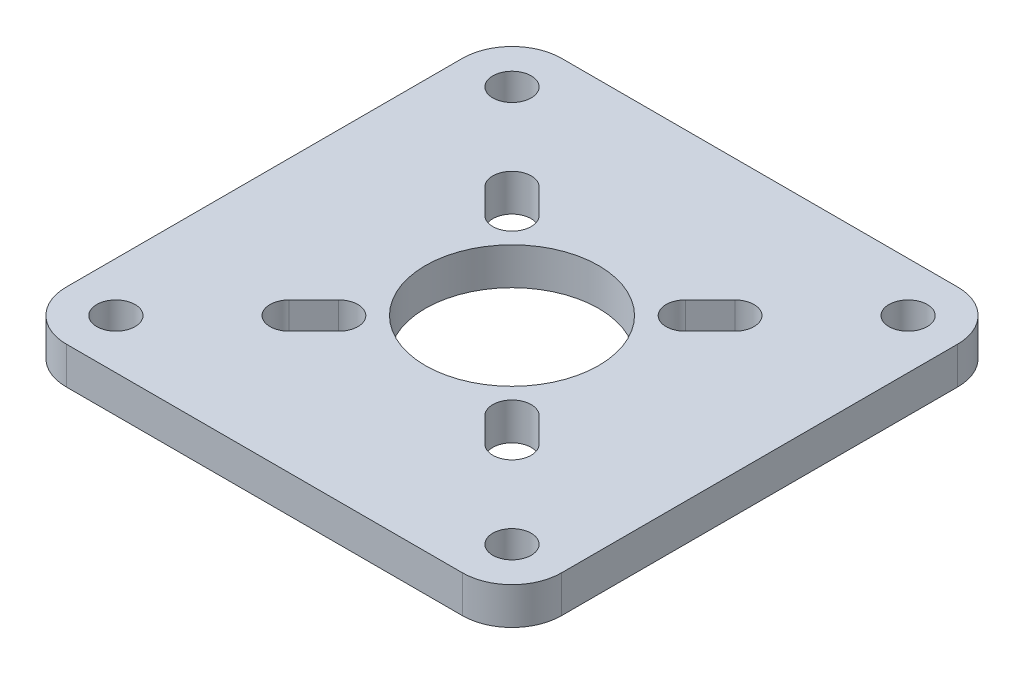
ISO-10303-21;
HEADER;
FILE_DESCRIPTION(('STEP AP214'),'2;1');
FILE_NAME('part.step','',(''),(''),'','','');
FILE_SCHEMA(('AUTOMOTIVE_DESIGN { 1 0 10303 214 1 1 1 1 }'));
ENDSEC;
DATA;
#1=APPLICATION_CONTEXT('core data for automotive mechanical design processes');
#2=APPLICATION_PROTOCOL_DEFINITION('international standard','automotive_design',2000,#1);
#3=PRODUCT_CONTEXT('',#1,'mechanical');
#4=PRODUCT('Part','Part','',(#3));
#5=PRODUCT_RELATED_PRODUCT_CATEGORY('part','',(#4));
#6=PRODUCT_DEFINITION_FORMATION('','',#4);
#7=PRODUCT_DEFINITION_CONTEXT('part definition',#1,'design');
#8=PRODUCT_DEFINITION('design','',#6,#7);
#9=PRODUCT_DEFINITION_SHAPE('','',#8);
#10=(LENGTH_UNIT() NAMED_UNIT(*) SI_UNIT(.MILLI.,.METRE.));
#11=(NAMED_UNIT(*) PLANE_ANGLE_UNIT() SI_UNIT($,.RADIAN.));
#12=(NAMED_UNIT(*) SI_UNIT($,.STERADIAN.) SOLID_ANGLE_UNIT());
#13=UNCERTAINTY_MEASURE_WITH_UNIT(LENGTH_MEASURE(1.E-05),#10,'distance_accuracy_value','');
#14=(GEOMETRIC_REPRESENTATION_CONTEXT(3) GLOBAL_UNCERTAINTY_ASSIGNED_CONTEXT((#13)) GLOBAL_UNIT_ASSIGNED_CONTEXT((#10,
#11,#12)) REPRESENTATION_CONTEXT('',''));
#15=CARTESIAN_POINT('',(0.,0.,0.));
#16=DIRECTION('',(0.,0.,1.));
#17=DIRECTION('',(1.,0.,0.));
#18=AXIS2_PLACEMENT_3D('',#15,#16,#17);
#19=CARTESIAN_POINT('',(0.,1.5,0.));
#20=DIRECTION('',(0.,-1.,0.));
#21=DIRECTION('',(0.,0.,-1.));
#22=AXIS2_PLACEMENT_3D('',#19,#20,#21);
#23=PLANE('',#22);
#24=CARTESIAN_POINT('',(-16.,1.5,-16.));
#25=DIRECTION('',(0.,1.,0.));
#26=DIRECTION('',(0.,0.,1.));
#27=AXIS2_PLACEMENT_3D('',#24,#25,#26);
#28=CIRCLE('',#27,1.55);
#29=CARTESIAN_POINT('',(-16.,1.5,-14.45));
#30=VERTEX_POINT('',#29);
#31=EDGE_CURVE('E428',#30,#30,#28,.T.);
#32=ORIENTED_EDGE('',*,*,#31,.F.);
#33=EDGE_LOOP('',(#32));
#34=FACE_BOUND('',#33,.T.);
#35=CARTESIAN_POINT('',(-8.99999999999999,1.5,-9.00000000000008));
#36=DIRECTION('',(0.,1.,0.));
#37=DIRECTION('',(0.,0.,1.));
#38=AXIS2_PLACEMENT_3D('',#35,#36,#37);
#39=CIRCLE('',#38,1.54999999999998);
#40=CARTESIAN_POINT('',(-7.9039844891609,1.5,-10.0960155108392));
#41=VERTEX_POINT('',#40);
#42=CARTESIAN_POINT('',(-10.0960155108392,1.5,-7.9039844891609));
#43=VERTEX_POINT('',#42);
#44=EDGE_CURVE('E463',#41,#43,#39,.T.);
#45=ORIENTED_EDGE('',*,*,#44,.F.);
#46=DIRECTION('',(-0.707106781186552,0.,-0.707106781186543));
#47=VECTOR('',#46,1.);
#48=CARTESIAN_POINT('',(1.09601551083919,1.5,-1.0960155108392));
#49=LINE('',#48,#47);
#50=CARTESIAN_POINT('',(-5.90398448916085,1.5,-8.09601551083915));
#51=VERTEX_POINT('',#50);
#52=EDGE_CURVE('E466',#51,#41,#49,.T.);
#53=ORIENTED_EDGE('',*,*,#52,.F.);
#54=CARTESIAN_POINT('',(-7.,1.5,-7.));
#55=DIRECTION('',(0.,1.,0.));
#56=DIRECTION('',(0.,0.,1.));
#57=AXIS2_PLACEMENT_3D('',#54,#55,#56);
#58=CIRCLE('',#57,1.55);
#59=CARTESIAN_POINT('',(-8.09601551083915,1.5,-5.90398448916085));
#60=VERTEX_POINT('',#59);
#61=EDGE_CURVE('E458',#60,#51,#58,.T.);
#62=ORIENTED_EDGE('',*,*,#61,.F.);
#63=DIRECTION('',(-0.707106781186542,0.,-0.707106781186553));
#64=VECTOR('',#63,1.);
#65=CARTESIAN_POINT('',(-1.09601551083921,1.5,1.09601551083919));
#66=LINE('',#65,#64);
#67=EDGE_CURVE('E178',#60,#43,#66,.T.);
#68=ORIENTED_EDGE('',*,*,#67,.T.);
#69=EDGE_LOOP('',(#45,#53,#62,#68));
#70=FACE_BOUND('',#69,.T.);
#71=DIRECTION('',(0.,0.,1.));
#72=VECTOR('',#71,1.);
#73=CARTESIAN_POINT('',(-20.,1.5,20.));
#74=LINE('',#73,#72);
#75=CARTESIAN_POINT('',(-20.,1.5,-16.));
#76=VERTEX_POINT('',#75);
#77=CARTESIAN_POINT('',(-20.,1.5,16.));
#78=VERTEX_POINT('',#77);
#79=EDGE_CURVE('E485',#76,#78,#74,.T.);
#80=ORIENTED_EDGE('',*,*,#79,.T.);
#81=CARTESIAN_POINT('',(-16.,1.5,16.));
#82=DIRECTION('',(0.,-1.,0.));
#83=DIRECTION('',(0.,0.,-1.));
#84=AXIS2_PLACEMENT_3D('',#81,#82,#83);
#85=CIRCLE('',#84,4.);
#86=CARTESIAN_POINT('',(-16.,1.5,20.));
#87=VERTEX_POINT('',#86);
#88=EDGE_CURVE('E525',#78,#87,#85,.F.);
#89=ORIENTED_EDGE('',*,*,#88,.T.);
#90=DIRECTION('',(1.,0.,0.));
#91=VECTOR('',#90,1.);
#92=CARTESIAN_POINT('',(-20.,1.5,20.));
#93=LINE('',#92,#91);
#94=CARTESIAN_POINT('',(16.,1.5,20.));
#95=VERTEX_POINT('',#94);
#96=EDGE_CURVE('E488',#87,#95,#93,.T.);
#97=ORIENTED_EDGE('',*,*,#96,.T.);
#98=CARTESIAN_POINT('',(16.,1.5,16.));
#99=DIRECTION('',(0.,-1.,0.));
#100=DIRECTION('',(0.,0.,-1.));
#101=AXIS2_PLACEMENT_3D('',#98,#99,#100);
#102=CIRCLE('',#101,4.);
#103=CARTESIAN_POINT('',(20.,1.5,16.));
#104=VERTEX_POINT('',#103);
#105=EDGE_CURVE('E523',#95,#104,#102,.F.);
#106=ORIENTED_EDGE('',*,*,#105,.T.);
#107=DIRECTION('',(0.,0.,-1.));
#108=VECTOR('',#107,1.);
#109=CARTESIAN_POINT('',(20.,1.5,20.));
#110=LINE('',#109,#108);
#111=CARTESIAN_POINT('',(20.,1.5,-16.));
#112=VERTEX_POINT('',#111);
#113=EDGE_CURVE('E478',#104,#112,#110,.T.);
#114=ORIENTED_EDGE('',*,*,#113,.T.);
#115=CARTESIAN_POINT('',(16.,1.5,-16.));
#116=DIRECTION('',(0.,-1.,0.));
#117=DIRECTION('',(0.,0.,-1.));
#118=AXIS2_PLACEMENT_3D('',#115,#116,#117);
#119=CIRCLE('',#118,4.);
#120=CARTESIAN_POINT('',(16.,1.5,-20.));
#121=VERTEX_POINT('',#120);
#122=EDGE_CURVE('E521',#112,#121,#119,.F.);
#123=ORIENTED_EDGE('',*,*,#122,.T.);
#124=DIRECTION('',(-1.,0.,0.));
#125=VECTOR('',#124,1.);
#126=CARTESIAN_POINT('',(-20.,1.5,-20.));
#127=LINE('',#126,#125);
#128=CARTESIAN_POINT('',(-16.,1.5,-20.));
#129=VERTEX_POINT('',#128);
#130=EDGE_CURVE('E481',#121,#129,#127,.T.);
#131=ORIENTED_EDGE('',*,*,#130,.T.);
#132=CARTESIAN_POINT('',(-16.,1.5,-16.));
#133=DIRECTION('',(0.,-1.,0.));
#134=DIRECTION('',(0.,0.,-1.));
#135=AXIS2_PLACEMENT_3D('',#132,#133,#134);
#136=CIRCLE('',#135,4.);
#137=EDGE_CURVE('E519',#129,#76,#136,.F.);
#138=ORIENTED_EDGE('',*,*,#137,.T.);
#139=EDGE_LOOP('',(#80,#89,#97,#106,#114,#123,#131,#138));
#140=FACE_BOUND('',#139,.T.);
#141=CARTESIAN_POINT('',(16.,1.5,16.));
#142=DIRECTION('',(0.,1.,0.));
#143=DIRECTION('',(0.,0.,1.));
#144=AXIS2_PLACEMENT_3D('',#141,#142,#143);
#145=CIRCLE('',#144,1.55);
#146=CARTESIAN_POINT('',(16.,1.5,17.55));
#147=VERTEX_POINT('',#146);
#148=EDGE_CURVE('E432',#147,#147,#145,.T.);
#149=ORIENTED_EDGE('',*,*,#148,.F.);
#150=EDGE_LOOP('',(#149));
#151=FACE_BOUND('',#150,.T.);
#152=CARTESIAN_POINT('',(-9.,1.5,9.00000000000008));
#153=DIRECTION('',(0.,1.,0.));
#154=DIRECTION('',(0.,0.,1.));
#155=AXIS2_PLACEMENT_3D('',#152,#153,#154);
#156=CIRCLE('',#155,1.54999999999998);
#157=CARTESIAN_POINT('',(-7.9039844891609,1.5,10.0960155108392));
#158=VERTEX_POINT('',#157);
#159=CARTESIAN_POINT('',(-10.0960155108392,1.5,7.9039844891609));
#160=VERTEX_POINT('',#159);
#161=EDGE_CURVE('E373',#158,#160,#156,.F.);
#162=ORIENTED_EDGE('',*,*,#161,.T.);
#163=DIRECTION('',(-0.707106781186543,0.,0.707106781186552));
#164=VECTOR('',#163,1.);
#165=CARTESIAN_POINT('',(-1.0960155108392,1.5,-1.09601551083919));
#166=LINE('',#165,#164);
#167=CARTESIAN_POINT('',(-8.09601551083915,1.5,5.90398448916085));
#168=VERTEX_POINT('',#167);
#169=EDGE_CURVE('E380',#168,#160,#166,.T.);
#170=ORIENTED_EDGE('',*,*,#169,.F.);
#171=CARTESIAN_POINT('',(-6.99999999999999,1.5,7.));
#172=DIRECTION('',(0.,1.,0.));
#173=DIRECTION('',(0.,0.,1.));
#174=AXIS2_PLACEMENT_3D('',#171,#172,#173);
#175=CIRCLE('',#174,1.55);
#176=CARTESIAN_POINT('',(-5.90398448916084,1.5,8.09601551083915));
#177=VERTEX_POINT('',#176);
#178=EDGE_CURVE('E367',#168,#177,#175,.F.);
#179=ORIENTED_EDGE('',*,*,#178,.T.);
#180=DIRECTION('',(-0.707106781186552,0.,0.707106781186543));
#181=VECTOR('',#180,1.);
#182=CARTESIAN_POINT('',(1.09601551083919,1.5,1.0960155108392));
#183=LINE('',#182,#181);
#184=EDGE_CURVE('E366',#177,#158,#183,.T.);
#185=ORIENTED_EDGE('',*,*,#184,.T.);
#186=EDGE_LOOP('',(#162,#170,#179,#185));
#187=FACE_BOUND('',#186,.T.);
#188=DIRECTION('',(0.707106781186542,0.,0.707106781186553));
#189=VECTOR('',#188,1.);
#190=CARTESIAN_POINT('',(1.09601551083922,1.5,-1.0960155108392));
#191=LINE('',#190,#189);
#192=CARTESIAN_POINT('',(8.09601551083915,1.5,5.90398448916084));
#193=VERTEX_POINT('',#192);
#194=CARTESIAN_POINT('',(10.0960155108392,1.5,7.9039844891609));
#195=VERTEX_POINT('',#194);
#196=EDGE_CURVE('E403',#193,#195,#191,.T.);
#197=ORIENTED_EDGE('',*,*,#196,.T.);
#198=CARTESIAN_POINT('',(9.,1.5,9.00000000000007));
#199=DIRECTION('',(0.,1.,0.));
#200=DIRECTION('',(0.,0.,1.));
#201=AXIS2_PLACEMENT_3D('',#198,#199,#200);
#202=CIRCLE('',#201,1.54999999999998);
#203=CARTESIAN_POINT('',(7.9039844891609,1.5,10.0960155108392));
#204=VERTEX_POINT('',#203);
#205=EDGE_CURVE('E419',#204,#195,#202,.T.);
#206=ORIENTED_EDGE('',*,*,#205,.F.);
#207=DIRECTION('',(0.707106781186552,0.,0.707106781186543));
#208=VECTOR('',#207,1.);
#209=CARTESIAN_POINT('',(-1.09601551083919,1.5,1.0960155108392));
#210=LINE('',#209,#208);
#211=CARTESIAN_POINT('',(5.90398448916084,1.5,8.09601551083915));
#212=VERTEX_POINT('',#211);
#213=EDGE_CURVE('E409',#212,#204,#210,.T.);
#214=ORIENTED_EDGE('',*,*,#213,.F.);
#215=CARTESIAN_POINT('',(7.,1.5,7.));
#216=DIRECTION('',(0.,1.,0.));
#217=DIRECTION('',(0.,0.,1.));
#218=AXIS2_PLACEMENT_3D('',#215,#216,#217);
#219=CIRCLE('',#218,1.55000000000001);
#220=EDGE_CURVE('E416',#193,#212,#219,.T.);
#221=ORIENTED_EDGE('',*,*,#220,.F.);
#222=EDGE_LOOP('',(#197,#206,#214,#221));
#223=FACE_BOUND('',#222,.T.);
#224=CARTESIAN_POINT('',(0.,1.5,0.));
#225=DIRECTION('',(0.,1.,0.));
#226=DIRECTION('',(0.,0.,1.));
#227=AXIS2_PLACEMENT_3D('',#224,#225,#226);
#228=CIRCLE('',#227,7.);
#229=CARTESIAN_POINT('',(0.,1.5,7.));
#230=VERTEX_POINT('',#229);
#231=EDGE_CURVE('E349',#230,#230,#228,.T.);
#232=ORIENTED_EDGE('',*,*,#231,.F.);
#233=EDGE_LOOP('',(#232));
#234=FACE_BOUND('',#233,.T.);
#235=CARTESIAN_POINT('',(8.99999999999999,1.5,-9.00000000000007));
#236=DIRECTION('',(0.,1.,0.));
#237=DIRECTION('',(0.,0.,1.));
#238=AXIS2_PLACEMENT_3D('',#235,#236,#237);
#239=CIRCLE('',#238,1.54999999999998);
#240=CARTESIAN_POINT('',(7.9039844891609,1.5,-10.0960155108392));
#241=VERTEX_POINT('',#240);
#242=CARTESIAN_POINT('',(10.0960155108392,1.5,-7.9039844891609));
#243=VERTEX_POINT('',#242);
#244=EDGE_CURVE('E186',#241,#243,#239,.F.);
#245=ORIENTED_EDGE('',*,*,#244,.T.);
#246=DIRECTION('',(0.707106781186542,0.,-0.707106781186553));
#247=VECTOR('',#246,1.);
#248=CARTESIAN_POINT('',(1.09601551083921,1.5,1.09601551083919));
#249=LINE('',#248,#247);
#250=CARTESIAN_POINT('',(8.09601551083915,1.5,-5.90398448916085));
#251=VERTEX_POINT('',#250);
#252=EDGE_CURVE('E341',#251,#243,#249,.T.);
#253=ORIENTED_EDGE('',*,*,#252,.F.);
#254=CARTESIAN_POINT('',(7.,1.5,-7.));
#255=DIRECTION('',(0.,1.,0.));
#256=DIRECTION('',(0.,0.,1.));
#257=AXIS2_PLACEMENT_3D('',#254,#255,#256);
#258=CIRCLE('',#257,1.55);
#259=CARTESIAN_POINT('',(5.90398448916084,1.5,-8.09601551083915));
#260=VERTEX_POINT('',#259);
#261=EDGE_CURVE('E358',#251,#260,#258,.F.);
#262=ORIENTED_EDGE('',*,*,#261,.T.);
#263=DIRECTION('',(0.707106781186552,0.,-0.707106781186543));
#264=VECTOR('',#263,1.);
#265=CARTESIAN_POINT('',(-1.09601551083919,1.5,-1.09601551083921));
#266=LINE('',#265,#264);
#267=EDGE_CURVE('E356',#260,#241,#266,.T.);
#268=ORIENTED_EDGE('',*,*,#267,.T.);
#269=EDGE_LOOP('',(#245,#253,#262,#268));
#270=FACE_BOUND('',#269,.T.);
#271=CARTESIAN_POINT('',(-16.,1.5,16.));
#272=DIRECTION('',(0.,1.,0.));
#273=DIRECTION('',(0.,0.,1.));
#274=AXIS2_PLACEMENT_3D('',#271,#272,#273);
#275=CIRCLE('',#274,1.55);
#276=CARTESIAN_POINT('',(-16.,1.5,17.55));
#277=VERTEX_POINT('',#276);
#278=EDGE_CURVE('E436',#277,#277,#275,.F.);
#279=ORIENTED_EDGE('',*,*,#278,.T.);
#280=EDGE_LOOP('',(#279));
#281=FACE_BOUND('',#280,.T.);
#282=CARTESIAN_POINT('',(16.,1.5,-16.));
#283=DIRECTION('',(0.,1.,0.));
#284=DIRECTION('',(0.,0.,1.));
#285=AXIS2_PLACEMENT_3D('',#282,#283,#284);
#286=CIRCLE('',#285,1.55);
#287=CARTESIAN_POINT('',(16.,1.5,-14.45));
#288=VERTEX_POINT('',#287);
#289=EDGE_CURVE('E429',#288,#288,#286,.F.);
#290=ORIENTED_EDGE('',*,*,#289,.T.);
#291=EDGE_LOOP('',(#290));
#292=FACE_BOUND('',#291,.T.);
#293=ADVANCED_FACE('F163',(#34,#70,#140,#151,#187,#223,#234,#270,#281,#292),#23,.F.);
#294=CARTESIAN_POINT('',(0.,-1.5,0.));
#295=DIRECTION('',(0.,-1.,0.));
#296=DIRECTION('',(0.,0.,-1.));
#297=AXIS2_PLACEMENT_3D('',#294,#295,#296);
#298=PLANE('',#297);
#299=CARTESIAN_POINT('',(-16.,-1.5,-16.));
#300=DIRECTION('',(0.,-1.,0.));
#301=DIRECTION('',(0.,0.,-1.));
#302=AXIS2_PLACEMENT_3D('',#299,#300,#301);
#303=CIRCLE('',#302,1.55);
#304=CARTESIAN_POINT('',(-16.,-1.5,-17.55));
#305=VERTEX_POINT('',#304);
#306=EDGE_CURVE('E425',#305,#305,#303,.F.);
#307=ORIENTED_EDGE('',*,*,#306,.T.);
#308=EDGE_LOOP('',(#307));
#309=FACE_BOUND('',#308,.T.);
#310=CARTESIAN_POINT('',(-16.,-1.5,16.));
#311=DIRECTION('',(0.,-1.,0.));
#312=DIRECTION('',(0.,0.,-1.));
#313=AXIS2_PLACEMENT_3D('',#310,#311,#312);
#314=CIRCLE('',#313,1.55);
#315=CARTESIAN_POINT('',(-16.,-1.5,14.45));
#316=VERTEX_POINT('',#315);
#317=EDGE_CURVE('E439',#316,#316,#314,.T.);
#318=ORIENTED_EDGE('',*,*,#317,.F.);
#319=EDGE_LOOP('',(#318));
#320=FACE_BOUND('',#319,.T.);
#321=DIRECTION('',(-0.707106781186552,0.,-0.707106781186543));
#322=VECTOR('',#321,1.);
#323=CARTESIAN_POINT('',(1.09601551083919,-1.5,-1.0960155108392));
#324=LINE('',#323,#322);
#325=CARTESIAN_POINT('',(-5.90398448916085,-1.5,-8.09601551083915));
#326=VERTEX_POINT('',#325);
#327=CARTESIAN_POINT('',(-7.9039844891609,-1.5,-10.0960155108392));
#328=VERTEX_POINT('',#327);
#329=EDGE_CURVE('E449',#326,#328,#324,.T.);
#330=ORIENTED_EDGE('',*,*,#329,.T.);
#331=CARTESIAN_POINT('',(-8.99999999999999,-1.5,-9.00000000000008));
#332=DIRECTION('',(0.,-1.,0.));
#333=DIRECTION('',(0.,0.,-1.));
#334=AXIS2_PLACEMENT_3D('',#331,#332,#333);
#335=CIRCLE('',#334,1.54999999999998);
#336=CARTESIAN_POINT('',(-10.0960155108391,-1.5,-7.90398448916094));
#337=VERTEX_POINT('',#336);
#338=EDGE_CURVE('E450',#328,#337,#335,.F.);
#339=ORIENTED_EDGE('',*,*,#338,.T.);
#340=DIRECTION('',(-0.707106781186542,0.,-0.707106781186553));
#341=VECTOR('',#340,1.);
#342=CARTESIAN_POINT('',(-1.09601551083921,-1.5,1.09601551083919));
#343=LINE('',#342,#341);
#344=CARTESIAN_POINT('',(-8.09601551083915,-1.5,-5.90398448916085));
#345=VERTEX_POINT('',#344);
#346=EDGE_CURVE('E442',#345,#337,#343,.T.);
#347=ORIENTED_EDGE('',*,*,#346,.F.);
#348=CARTESIAN_POINT('',(-7.,-1.5,-7.));
#349=DIRECTION('',(0.,-1.,0.));
#350=DIRECTION('',(0.,0.,-1.));
#351=AXIS2_PLACEMENT_3D('',#348,#349,#350);
#352=CIRCLE('',#351,1.55);
#353=EDGE_CURVE('E446',#345,#326,#352,.F.);
#354=ORIENTED_EDGE('',*,*,#353,.T.);
#355=EDGE_LOOP('',(#330,#339,#347,#354));
#356=FACE_BOUND('',#355,.T.);
#357=CARTESIAN_POINT('',(0.,-1.5,0.));
#358=DIRECTION('',(0.,-1.,0.));
#359=DIRECTION('',(0.,0.,-1.));
#360=AXIS2_PLACEMENT_3D('',#357,#358,#359);
#361=CIRCLE('',#360,7.);
#362=CARTESIAN_POINT('',(0.,-1.5,-7.));
#363=VERTEX_POINT('',#362);
#364=EDGE_CURVE('E843',#363,#363,#361,.F.);
#365=ORIENTED_EDGE('',*,*,#364,.T.);
#366=EDGE_LOOP('',(#365));
#367=FACE_BOUND('',#366,.T.);
#368=CARTESIAN_POINT('',(9.,-1.5,9.00000000000007));
#369=DIRECTION('',(0.,-1.,0.));
#370=DIRECTION('',(0.,0.,-1.));
#371=AXIS2_PLACEMENT_3D('',#368,#369,#370);
#372=CIRCLE('',#371,1.54999999999998);
#373=CARTESIAN_POINT('',(7.9039844891609,-1.5,10.0960155108392));
#374=VERTEX_POINT('',#373);
#375=CARTESIAN_POINT('',(10.0960155108392,-1.5,7.9039844891609));
#376=VERTEX_POINT('',#375);
#377=EDGE_CURVE('E400',#374,#376,#372,.F.);
#378=ORIENTED_EDGE('',*,*,#377,.T.);
#379=DIRECTION('',(0.707106781186542,0.,0.707106781186553));
#380=VECTOR('',#379,1.);
#381=CARTESIAN_POINT('',(1.09601551083922,-1.5,-1.0960155108392));
#382=LINE('',#381,#380);
#383=CARTESIAN_POINT('',(8.09601551083915,-1.5,5.90398448916084));
#384=VERTEX_POINT('',#383);
#385=EDGE_CURVE('E389',#384,#376,#382,.T.);
#386=ORIENTED_EDGE('',*,*,#385,.F.);
#387=CARTESIAN_POINT('',(7.,-1.5,7.));
#388=DIRECTION('',(0.,-1.,0.));
#389=DIRECTION('',(0.,0.,-1.));
#390=AXIS2_PLACEMENT_3D('',#387,#388,#389);
#391=CIRCLE('',#390,1.55000000000001);
#392=CARTESIAN_POINT('',(5.90398448916084,-1.5,8.09601551083915));
#393=VERTEX_POINT('',#392);
#394=EDGE_CURVE('E407',#384,#393,#391,.F.);
#395=ORIENTED_EDGE('',*,*,#394,.T.);
#396=DIRECTION('',(0.707106781186552,0.,0.707106781186543));
#397=VECTOR('',#396,1.);
#398=CARTESIAN_POINT('',(-1.09601551083919,-1.5,1.0960155108392));
#399=LINE('',#398,#397);
#400=EDGE_CURVE('E397',#393,#374,#399,.T.);
#401=ORIENTED_EDGE('',*,*,#400,.T.);
#402=EDGE_LOOP('',(#378,#386,#395,#401));
#403=FACE_BOUND('',#402,.T.);
#404=DIRECTION('',(-0.707106781186543,0.,0.707106781186552));
#405=VECTOR('',#404,1.);
#406=CARTESIAN_POINT('',(-1.0960155108392,-1.5,-1.09601551083919));
#407=LINE('',#406,#405);
#408=CARTESIAN_POINT('',(-8.09601551083914,-1.5,5.90398448916085));
#409=VERTEX_POINT('',#408);
#410=CARTESIAN_POINT('',(-10.0960155108392,-1.5,7.9039844891609));
#411=VERTEX_POINT('',#410);
#412=EDGE_CURVE('E370',#409,#411,#407,.T.);
#413=ORIENTED_EDGE('',*,*,#412,.T.);
#414=CARTESIAN_POINT('',(-9.,-1.5,9.00000000000008));
#415=DIRECTION('',(0.,-1.,0.));
#416=DIRECTION('',(0.,0.,-1.));
#417=AXIS2_PLACEMENT_3D('',#414,#415,#416);
#418=CIRCLE('',#417,1.54999999999998);
#419=CARTESIAN_POINT('',(-7.90398448916086,-1.5,10.0960155108392));
#420=VERTEX_POINT('',#419);
#421=EDGE_CURVE('E377',#420,#411,#418,.T.);
#422=ORIENTED_EDGE('',*,*,#421,.F.);
#423=DIRECTION('',(-0.707106781186552,0.,0.707106781186543));
#424=VECTOR('',#423,1.);
#425=CARTESIAN_POINT('',(1.09601551083919,-1.5,1.0960155108392));
#426=LINE('',#425,#424);
#427=CARTESIAN_POINT('',(-5.90398448916084,-1.5,8.09601551083915));
#428=VERTEX_POINT('',#427);
#429=EDGE_CURVE('E379',#428,#420,#426,.T.);
#430=ORIENTED_EDGE('',*,*,#429,.F.);
#431=CARTESIAN_POINT('',(-6.99999999999999,-1.5,7.));
#432=DIRECTION('',(0.,-1.,0.));
#433=DIRECTION('',(0.,0.,-1.));
#434=AXIS2_PLACEMENT_3D('',#431,#432,#433);
#435=CIRCLE('',#434,1.55);
#436=EDGE_CURVE('E382',#409,#428,#435,.T.);
#437=ORIENTED_EDGE('',*,*,#436,.F.);
#438=EDGE_LOOP('',(#413,#422,#430,#437));
#439=FACE_BOUND('',#438,.T.);
#440=CARTESIAN_POINT('',(16.,-1.5,16.));
#441=DIRECTION('',(0.,-1.,0.));
#442=DIRECTION('',(0.,0.,-1.));
#443=AXIS2_PLACEMENT_3D('',#440,#441,#442);
#444=CIRCLE('',#443,1.55);
#445=CARTESIAN_POINT('',(16.,-1.5,14.45));
#446=VERTEX_POINT('',#445);
#447=EDGE_CURVE('E474',#446,#446,#444,.F.);
#448=ORIENTED_EDGE('',*,*,#447,.T.);
#449=EDGE_LOOP('',(#448));
#450=FACE_BOUND('',#449,.T.);
#451=DIRECTION('',(1.,0.,0.));
#452=VECTOR('',#451,1.);
#453=CARTESIAN_POINT('',(-20.,-1.5,20.));
#454=LINE('',#453,#452);
#455=CARTESIAN_POINT('',(-16.,-1.5,20.));
#456=VERTEX_POINT('',#455);
#457=CARTESIAN_POINT('',(16.,-1.5,20.));
#458=VERTEX_POINT('',#457);
#459=EDGE_CURVE('E482',#456,#458,#454,.T.);
#460=ORIENTED_EDGE('',*,*,#459,.F.);
#461=CARTESIAN_POINT('',(-16.,-1.5,16.));
#462=DIRECTION('',(0.,-1.,0.));
#463=DIRECTION('',(0.,0.,-1.));
#464=AXIS2_PLACEMENT_3D('',#461,#462,#463);
#465=CIRCLE('',#464,4.);
#466=CARTESIAN_POINT('',(-20.,-1.5,16.));
#467=VERTEX_POINT('',#466);
#468=EDGE_CURVE('E512',#456,#467,#465,.T.);
#469=ORIENTED_EDGE('',*,*,#468,.T.);
#470=DIRECTION('',(0.,0.,1.));
#471=VECTOR('',#470,1.);
#472=CARTESIAN_POINT('',(-20.,-1.5,20.));
#473=LINE('',#472,#471);
#474=CARTESIAN_POINT('',(-20.,-1.5,-16.));
#475=VERTEX_POINT('',#474);
#476=EDGE_CURVE('E497',#475,#467,#473,.T.);
#477=ORIENTED_EDGE('',*,*,#476,.F.);
#478=CARTESIAN_POINT('',(-16.,-1.5,-16.));
#479=DIRECTION('',(0.,-1.,0.));
#480=DIRECTION('',(0.,0.,-1.));
#481=AXIS2_PLACEMENT_3D('',#478,#479,#480);
#482=CIRCLE('',#481,4.);
#483=CARTESIAN_POINT('',(-16.,-1.5,-20.));
#484=VERTEX_POINT('',#483);
#485=EDGE_CURVE('E506',#475,#484,#482,.T.);
#486=ORIENTED_EDGE('',*,*,#485,.T.);
#487=DIRECTION('',(-1.,0.,0.));
#488=VECTOR('',#487,1.);
#489=CARTESIAN_POINT('',(-20.,-1.5,-20.));
#490=LINE('',#489,#488);
#491=CARTESIAN_POINT('',(16.,-1.5,-20.));
#492=VERTEX_POINT('',#491);
#493=EDGE_CURVE('E494',#492,#484,#490,.T.);
#494=ORIENTED_EDGE('',*,*,#493,.F.);
#495=CARTESIAN_POINT('',(16.,-1.5,-16.));
#496=DIRECTION('',(0.,-1.,0.));
#497=DIRECTION('',(0.,0.,-1.));
#498=AXIS2_PLACEMENT_3D('',#495,#496,#497);
#499=CIRCLE('',#498,4.);
#500=CARTESIAN_POINT('',(20.,-1.5,-16.));
#501=VERTEX_POINT('',#500);
#502=EDGE_CURVE('E508',#492,#501,#499,.T.);
#503=ORIENTED_EDGE('',*,*,#502,.T.);
#504=DIRECTION('',(0.,0.,-1.));
#505=VECTOR('',#504,1.);
#506=CARTESIAN_POINT('',(20.,-1.5,20.));
#507=LINE('',#506,#505);
#508=CARTESIAN_POINT('',(20.,-1.5,16.));
#509=VERTEX_POINT('',#508);
#510=EDGE_CURVE('E477',#509,#501,#507,.T.);
#511=ORIENTED_EDGE('',*,*,#510,.F.);
#512=CARTESIAN_POINT('',(16.,-1.5,16.));
#513=DIRECTION('',(0.,-1.,0.));
#514=DIRECTION('',(0.,0.,-1.));
#515=AXIS2_PLACEMENT_3D('',#512,#513,#514);
#516=CIRCLE('',#515,4.);
#517=EDGE_CURVE('E510',#509,#458,#516,.T.);
#518=ORIENTED_EDGE('',*,*,#517,.T.);
#519=EDGE_LOOP('',(#460,#469,#477,#486,#494,#503,#511,#518));
#520=FACE_BOUND('',#519,.T.);
#521=DIRECTION('',(0.707106781186542,0.,-0.707106781186553));
#522=VECTOR('',#521,1.);
#523=CARTESIAN_POINT('',(1.09601551083921,-1.5,1.09601551083919));
#524=LINE('',#523,#522);
#525=CARTESIAN_POINT('',(8.09601551083915,-1.5,-5.90398448916085));
#526=VERTEX_POINT('',#525);
#527=CARTESIAN_POINT('',(10.0960155108392,-1.5,-7.9039844891609));
#528=VERTEX_POINT('',#527);
#529=EDGE_CURVE('E346',#526,#528,#524,.T.);
#530=ORIENTED_EDGE('',*,*,#529,.T.);
#531=CARTESIAN_POINT('',(8.99999999999999,-1.5,-9.00000000000007));
#532=DIRECTION('',(0.,-1.,0.));
#533=DIRECTION('',(0.,0.,-1.));
#534=AXIS2_PLACEMENT_3D('',#531,#532,#533);
#535=CIRCLE('',#534,1.54999999999998);
#536=CARTESIAN_POINT('',(7.9039844891609,-1.5,-10.0960155108392));
#537=VERTEX_POINT('',#536);
#538=EDGE_CURVE('E327',#537,#528,#535,.T.);
#539=ORIENTED_EDGE('',*,*,#538,.F.);
#540=DIRECTION('',(0.707106781186552,0.,-0.707106781186543));
#541=VECTOR('',#540,1.);
#542=CARTESIAN_POINT('',(-1.09601551083919,-1.5,-1.09601551083921));
#543=LINE('',#542,#541);
#544=CARTESIAN_POINT('',(5.90398448916084,-1.5,-8.09601551083915));
#545=VERTEX_POINT('',#544);
#546=EDGE_CURVE('E336',#545,#537,#543,.T.);
#547=ORIENTED_EDGE('',*,*,#546,.F.);
#548=CARTESIAN_POINT('',(7.,-1.5,-7.));
#549=DIRECTION('',(0.,-1.,0.));
#550=DIRECTION('',(0.,0.,-1.));
#551=AXIS2_PLACEMENT_3D('',#548,#549,#550);
#552=CIRCLE('',#551,1.55);
#553=EDGE_CURVE('E347',#526,#545,#552,.T.);
#554=ORIENTED_EDGE('',*,*,#553,.F.);
#555=EDGE_LOOP('',(#530,#539,#547,#554));
#556=FACE_BOUND('',#555,.T.);
#557=CARTESIAN_POINT('',(16.,-1.5,-16.));
#558=DIRECTION('',(0.,-1.,0.));
#559=DIRECTION('',(0.,0.,-1.));
#560=AXIS2_PLACEMENT_3D('',#557,#558,#559);
#561=CIRCLE('',#560,1.55);
#562=CARTESIAN_POINT('',(16.,-1.5,-17.55));
#563=VERTEX_POINT('',#562);
#564=EDGE_CURVE('E433',#563,#563,#561,.T.);
#565=ORIENTED_EDGE('',*,*,#564,.F.);
#566=EDGE_LOOP('',(#565));
#567=FACE_BOUND('',#566,.T.);
#568=ADVANCED_FACE('F343',(#309,#320,#356,#367,#403,#439,#450,#520,#556,#567),#298,.T.);
#569=CARTESIAN_POINT('',(20.,1.5,20.));
#570=DIRECTION('',(-1.,0.,0.));
#571=DIRECTION('',(0.,0.,1.));
#572=AXIS2_PLACEMENT_3D('',#569,#570,#571);
#573=PLANE('',#572);
#574=ORIENTED_EDGE('',*,*,#113,.F.);
#575=DIRECTION('',(0.,-1.,0.));
#576=VECTOR('',#575,1.);
#577=CARTESIAN_POINT('',(20.,1.5,16.));
#578=LINE('',#577,#576);
#579=EDGE_CURVE('E529',#104,#509,#578,.T.);
#580=ORIENTED_EDGE('',*,*,#579,.T.);
#581=ORIENTED_EDGE('',*,*,#510,.T.);
#582=DIRECTION('',(0.,-1.,0.));
#583=VECTOR('',#582,1.);
#584=CARTESIAN_POINT('',(20.,1.5,-16.));
#585=LINE('',#584,#583);
#586=EDGE_CURVE('E527',#501,#112,#585,.F.);
#587=ORIENTED_EDGE('',*,*,#586,.T.);
#588=EDGE_LOOP('',(#574,#580,#581,#587));
#589=FACE_BOUND('',#588,.T.);
#590=ADVANCED_FACE('F565',(#589),#573,.F.);
#591=CARTESIAN_POINT('',(-20.,1.5,-20.));
#592=DIRECTION('',(0.,0.,1.));
#593=DIRECTION('',(1.,0.,0.));
#594=AXIS2_PLACEMENT_3D('',#591,#592,#593);
#595=PLANE('',#594);
#596=ORIENTED_EDGE('',*,*,#130,.F.);
#597=DIRECTION('',(0.,-1.,0.));
#598=VECTOR('',#597,1.);
#599=CARTESIAN_POINT('',(16.,1.5,-20.));
#600=LINE('',#599,#598);
#601=EDGE_CURVE('E12',#121,#492,#600,.T.);
#602=ORIENTED_EDGE('',*,*,#601,.T.);
#603=ORIENTED_EDGE('',*,*,#493,.T.);
#604=DIRECTION('',(0.,-1.,0.));
#605=VECTOR('',#604,1.);
#606=CARTESIAN_POINT('',(-16.,1.5,-20.));
#607=LINE('',#606,#605);
#608=EDGE_CURVE('E171',#484,#129,#607,.F.);
#609=ORIENTED_EDGE('',*,*,#608,.T.);
#610=EDGE_LOOP('',(#596,#602,#603,#609));
#611=FACE_BOUND('',#610,.T.);
#612=ADVANCED_FACE('F534',(#611),#595,.F.);
#613=CARTESIAN_POINT('',(-20.,1.5,20.));
#614=DIRECTION('',(1.,0.,0.));
#615=DIRECTION('',(0.,0.,-1.));
#616=AXIS2_PLACEMENT_3D('',#613,#614,#615);
#617=PLANE('',#616);
#618=ORIENTED_EDGE('',*,*,#476,.T.);
#619=DIRECTION('',(0.,-1.,0.));
#620=VECTOR('',#619,1.);
#621=CARTESIAN_POINT('',(-20.,1.5,16.));
#622=LINE('',#621,#620);
#623=EDGE_CURVE('E517',#467,#78,#622,.F.);
#624=ORIENTED_EDGE('',*,*,#623,.T.);
#625=ORIENTED_EDGE('',*,*,#79,.F.);
#626=DIRECTION('',(0.,-1.,0.));
#627=VECTOR('',#626,1.);
#628=CARTESIAN_POINT('',(-20.,1.5,-16.));
#629=LINE('',#628,#627);
#630=EDGE_CURVE('E514',#76,#475,#629,.T.);
#631=ORIENTED_EDGE('',*,*,#630,.T.);
#632=EDGE_LOOP('',(#618,#624,#625,#631));
#633=FACE_BOUND('',#632,.T.);
#634=ADVANCED_FACE('F546',(#633),#617,.F.);
#635=CARTESIAN_POINT('',(-20.,1.5,20.));
#636=DIRECTION('',(0.,0.,-1.));
#637=DIRECTION('',(-1.,0.,0.));
#638=AXIS2_PLACEMENT_3D('',#635,#636,#637);
#639=PLANE('',#638);
#640=ORIENTED_EDGE('',*,*,#96,.F.);
#641=DIRECTION('',(0.,-1.,0.));
#642=VECTOR('',#641,1.);
#643=CARTESIAN_POINT('',(-16.,1.5,20.));
#644=LINE('',#643,#642);
#645=EDGE_CURVE('E503',#87,#456,#644,.T.);
#646=ORIENTED_EDGE('',*,*,#645,.T.);
#647=ORIENTED_EDGE('',*,*,#459,.T.);
#648=DIRECTION('',(0.,-1.,0.));
#649=VECTOR('',#648,1.);
#650=CARTESIAN_POINT('',(16.,1.5,20.));
#651=LINE('',#650,#649);
#652=EDGE_CURVE('E491',#458,#95,#651,.F.);
#653=ORIENTED_EDGE('',*,*,#652,.T.);
#654=EDGE_LOOP('',(#640,#646,#647,#653));
#655=FACE_BOUND('',#654,.T.);
#656=ADVANCED_FACE('F556',(#655),#639,.F.);
#657=CARTESIAN_POINT('',(-16.,1.5,16.));
#658=DIRECTION('',(0.,-1.,0.));
#659=DIRECTION('',(0.,0.,-1.));
#660=AXIS2_PLACEMENT_3D('',#657,#658,#659);
#661=CYLINDRICAL_SURFACE('',#660,4.);
#662=ORIENTED_EDGE('',*,*,#88,.F.);
#663=ORIENTED_EDGE('',*,*,#623,.F.);
#664=ORIENTED_EDGE('',*,*,#468,.F.);
#665=ORIENTED_EDGE('',*,*,#645,.F.);
#666=EDGE_LOOP('',(#662,#663,#664,#665));
#667=FACE_BOUND('',#666,.T.);
#668=ADVANCED_FACE('F553',(#667),#661,.T.);
#669=CARTESIAN_POINT('',(16.,1.5,16.));
#670=DIRECTION('',(0.,-1.,0.));
#671=DIRECTION('',(0.,0.,-1.));
#672=AXIS2_PLACEMENT_3D('',#669,#670,#671);
#673=CYLINDRICAL_SURFACE('',#672,4.);
#674=ORIENTED_EDGE('',*,*,#105,.F.);
#675=ORIENTED_EDGE('',*,*,#652,.F.);
#676=ORIENTED_EDGE('',*,*,#517,.F.);
#677=ORIENTED_EDGE('',*,*,#579,.F.);
#678=EDGE_LOOP('',(#674,#675,#676,#677));
#679=FACE_BOUND('',#678,.T.);
#680=ADVANCED_FACE('F562',(#679),#673,.T.);
#681=CARTESIAN_POINT('',(16.,1.5,-16.));
#682=DIRECTION('',(0.,-1.,0.));
#683=DIRECTION('',(0.,0.,-1.));
#684=AXIS2_PLACEMENT_3D('',#681,#682,#683);
#685=CYLINDRICAL_SURFACE('',#684,4.);
#686=ORIENTED_EDGE('',*,*,#122,.F.);
#687=ORIENTED_EDGE('',*,*,#586,.F.);
#688=ORIENTED_EDGE('',*,*,#502,.F.);
#689=ORIENTED_EDGE('',*,*,#601,.F.);
#690=EDGE_LOOP('',(#686,#687,#688,#689));
#691=FACE_BOUND('',#690,.T.);
#692=ADVANCED_FACE('F568',(#691),#685,.T.);
#693=CARTESIAN_POINT('',(-16.,1.5,-16.));
#694=DIRECTION('',(0.,-1.,0.));
#695=DIRECTION('',(0.,0.,-1.));
#696=AXIS2_PLACEMENT_3D('',#693,#694,#695);
#697=CYLINDRICAL_SURFACE('',#696,4.);
#698=ORIENTED_EDGE('',*,*,#137,.F.);
#699=ORIENTED_EDGE('',*,*,#608,.F.);
#700=ORIENTED_EDGE('',*,*,#485,.F.);
#701=ORIENTED_EDGE('',*,*,#630,.F.);
#702=EDGE_LOOP('',(#698,#699,#700,#701));
#703=FACE_BOUND('',#702,.T.);
#704=ADVANCED_FACE('F165',(#703),#697,.T.);
#705=CARTESIAN_POINT('',(16.,-21.2989898732233,16.));
#706=DIRECTION('',(0.,1.,0.));
#707=DIRECTION('',(0.,0.,1.));
#708=AXIS2_PLACEMENT_3D('',#705,#706,#707);
#709=CYLINDRICAL_SURFACE('',#708,1.55);
#710=ORIENTED_EDGE('',*,*,#148,.T.);
#711=EDGE_LOOP('',(#710));
#712=FACE_BOUND('',#711,.T.);
#713=ORIENTED_EDGE('',*,*,#447,.F.);
#714=EDGE_LOOP('',(#713));
#715=FACE_BOUND('',#714,.T.);
#716=ADVANCED_FACE('F574',(#712,#715),#709,.F.);
#717=CARTESIAN_POINT('',(-1.0960155108392,-21.2989898732233,-1.09601551083919));
#718=DIRECTION('',(-0.707106781186552,0.,-0.707106781186543));
#719=DIRECTION('',(-0.707106781186543,0.,0.707106781186552));
#720=AXIS2_PLACEMENT_3D('',#717,#718,#719);
#721=PLANE('',#720);
#722=DIRECTION('',(0.,1.,0.));
#723=VECTOR('',#722,1.);
#724=CARTESIAN_POINT('',(-8.09601551083915,-21.2989898732233,5.90398448916085));
#725=LINE('',#724,#723);
#726=EDGE_CURVE('E364',#409,#168,#725,.T.);
#727=ORIENTED_EDGE('',*,*,#726,.T.);
#728=ORIENTED_EDGE('',*,*,#169,.T.);
#729=DIRECTION('',(0.,1.,0.));
#730=VECTOR('',#729,1.);
#731=CARTESIAN_POINT('',(-10.0960155108392,-21.2989898732233,7.9039844891609));
#732=LINE('',#731,#730);
#733=EDGE_CURVE('E368',#411,#160,#732,.T.);
#734=ORIENTED_EDGE('',*,*,#733,.F.);
#735=ORIENTED_EDGE('',*,*,#412,.F.);
#736=EDGE_LOOP('',(#727,#728,#734,#735));
#737=FACE_BOUND('',#736,.T.);
#738=ADVANCED_FACE('F635',(#737),#721,.F.);
#739=CARTESIAN_POINT('',(-9.,-21.2989898732233,9.00000000000008));
#740=DIRECTION('',(0.,1.,0.));
#741=DIRECTION('',(0.,0.,1.));
#742=AXIS2_PLACEMENT_3D('',#739,#740,#741);
#743=CYLINDRICAL_SURFACE('',#742,1.54999999999998);
#744=ORIENTED_EDGE('',*,*,#421,.T.);
#745=ORIENTED_EDGE('',*,*,#733,.T.);
#746=ORIENTED_EDGE('',*,*,#161,.F.);
#747=DIRECTION('',(0.,1.,0.));
#748=VECTOR('',#747,1.);
#749=CARTESIAN_POINT('',(-7.9039844891609,-21.2989898732233,10.0960155108392));
#750=LINE('',#749,#748);
#751=EDGE_CURVE('E371',#420,#158,#750,.T.);
#752=ORIENTED_EDGE('',*,*,#751,.F.);
#753=EDGE_LOOP('',(#744,#745,#746,#752));
#754=FACE_BOUND('',#753,.T.);
#755=ADVANCED_FACE('F644',(#754),#743,.F.);
#756=CARTESIAN_POINT('',(1.09601551083919,-21.2989898732233,1.0960155108392));
#757=DIRECTION('',(-0.707106781186543,0.,-0.707106781186552));
#758=DIRECTION('',(-0.707106781186552,0.,0.707106781186543));
#759=AXIS2_PLACEMENT_3D('',#756,#757,#758);
#760=PLANE('',#759);
#761=ORIENTED_EDGE('',*,*,#429,.T.);
#762=ORIENTED_EDGE('',*,*,#751,.T.);
#763=ORIENTED_EDGE('',*,*,#184,.F.);
#764=DIRECTION('',(0.,1.,0.));
#765=VECTOR('',#764,1.);
#766=CARTESIAN_POINT('',(-5.90398448916084,-21.2989898732233,8.09601551083915));
#767=LINE('',#766,#765);
#768=EDGE_CURVE('E374',#428,#177,#767,.T.);
#769=ORIENTED_EDGE('',*,*,#768,.F.);
#770=EDGE_LOOP('',(#761,#762,#763,#769));
#771=FACE_BOUND('',#770,.T.);
#772=ADVANCED_FACE('F654',(#771),#760,.T.);
#773=CARTESIAN_POINT('',(-6.99999999999999,-21.2989898732233,7.));
#774=DIRECTION('',(0.,1.,0.));
#775=DIRECTION('',(0.,0.,1.));
#776=AXIS2_PLACEMENT_3D('',#773,#774,#775);
#777=CYLINDRICAL_SURFACE('',#776,1.55);
#778=ORIENTED_EDGE('',*,*,#436,.T.);
#779=ORIENTED_EDGE('',*,*,#768,.T.);
#780=ORIENTED_EDGE('',*,*,#178,.F.);
#781=ORIENTED_EDGE('',*,*,#726,.F.);
#782=EDGE_LOOP('',(#778,#779,#780,#781));
#783=FACE_BOUND('',#782,.T.);
#784=ADVANCED_FACE('F664',(#783),#777,.F.);
#785=CARTESIAN_POINT('',(9.,-21.2989898732233,9.00000000000007));
#786=DIRECTION('',(0.,1.,0.));
#787=DIRECTION('',(0.,0.,1.));
#788=AXIS2_PLACEMENT_3D('',#785,#786,#787);
#789=CYLINDRICAL_SURFACE('',#788,1.54999999999998);
#790=DIRECTION('',(0.,1.,0.));
#791=VECTOR('',#790,1.);
#792=CARTESIAN_POINT('',(7.9039844891609,-21.2989898732233,10.0960155108392));
#793=LINE('',#792,#791);
#794=EDGE_CURVE('E332',#374,#204,#793,.T.);
#795=ORIENTED_EDGE('',*,*,#794,.T.);
#796=ORIENTED_EDGE('',*,*,#205,.T.);
#797=DIRECTION('',(0.,1.,0.));
#798=VECTOR('',#797,1.);
#799=CARTESIAN_POINT('',(10.0960155108392,-21.2989898732233,7.9039844891609));
#800=LINE('',#799,#798);
#801=EDGE_CURVE('E398',#376,#195,#800,.T.);
#802=ORIENTED_EDGE('',*,*,#801,.F.);
#803=ORIENTED_EDGE('',*,*,#377,.F.);
#804=EDGE_LOOP('',(#795,#796,#802,#803));
#805=FACE_BOUND('',#804,.T.);
#806=ADVANCED_FACE('F674',(#805),#789,.F.);
#807=CARTESIAN_POINT('',(1.09601551083922,-21.2989898732233,-1.0960155108392));
#808=DIRECTION('',(-0.707106781186553,0.,0.707106781186542));
#809=DIRECTION('',(0.707106781186542,0.,0.707106781186553));
#810=AXIS2_PLACEMENT_3D('',#807,#808,#809);
#811=PLANE('',#810);
#812=ORIENTED_EDGE('',*,*,#385,.T.);
#813=ORIENTED_EDGE('',*,*,#801,.T.);
#814=ORIENTED_EDGE('',*,*,#196,.F.);
#815=DIRECTION('',(0.,1.,0.));
#816=VECTOR('',#815,1.);
#817=CARTESIAN_POINT('',(8.09601551083915,-21.2989898732233,5.90398448916084));
#818=LINE('',#817,#816);
#819=EDGE_CURVE('E401',#384,#193,#818,.T.);
#820=ORIENTED_EDGE('',*,*,#819,.F.);
#821=EDGE_LOOP('',(#812,#813,#814,#820));
#822=FACE_BOUND('',#821,.T.);
#823=ADVANCED_FACE('F684',(#822),#811,.T.);
#824=CARTESIAN_POINT('',(7.,-21.2989898732233,7.));
#825=DIRECTION('',(0.,1.,0.));
#826=DIRECTION('',(0.,0.,1.));
#827=AXIS2_PLACEMENT_3D('',#824,#825,#826);
#828=CYLINDRICAL_SURFACE('',#827,1.55000000000001);
#829=ORIENTED_EDGE('',*,*,#819,.T.);
#830=ORIENTED_EDGE('',*,*,#220,.T.);
#831=DIRECTION('',(0.,1.,0.));
#832=VECTOR('',#831,1.);
#833=CARTESIAN_POINT('',(5.90398448916084,-21.2989898732233,8.09601551083915));
#834=LINE('',#833,#832);
#835=EDGE_CURVE('E404',#393,#212,#834,.T.);
#836=ORIENTED_EDGE('',*,*,#835,.F.);
#837=ORIENTED_EDGE('',*,*,#394,.F.);
#838=EDGE_LOOP('',(#829,#830,#836,#837));
#839=FACE_BOUND('',#838,.T.);
#840=ADVANCED_FACE('F694',(#839),#828,.F.);
#841=CARTESIAN_POINT('',(-1.09601551083919,-21.2989898732233,1.0960155108392));
#842=DIRECTION('',(-0.707106781186543,0.,0.707106781186552));
#843=DIRECTION('',(0.707106781186552,0.,0.707106781186543));
#844=AXIS2_PLACEMENT_3D('',#841,#842,#843);
#845=PLANE('',#844);
#846=ORIENTED_EDGE('',*,*,#835,.T.);
#847=ORIENTED_EDGE('',*,*,#213,.T.);
#848=ORIENTED_EDGE('',*,*,#794,.F.);
#849=ORIENTED_EDGE('',*,*,#400,.F.);
#850=EDGE_LOOP('',(#846,#847,#848,#849));
#851=FACE_BOUND('',#850,.T.);
#852=ADVANCED_FACE('F704',(#851),#845,.F.);
#853=CARTESIAN_POINT('',(0.,-21.2989898732233,0.));
#854=DIRECTION('',(0.,1.,0.));
#855=DIRECTION('',(0.,0.,1.));
#856=AXIS2_PLACEMENT_3D('',#853,#854,#855);
#857=CYLINDRICAL_SURFACE('',#856,7.);
#858=ORIENTED_EDGE('',*,*,#231,.T.);
#859=EDGE_LOOP('',(#858));
#860=FACE_BOUND('',#859,.T.);
#861=ORIENTED_EDGE('',*,*,#364,.F.);
#862=EDGE_LOOP('',(#861));
#863=FACE_BOUND('',#862,.T.);
#864=ADVANCED_FACE('F714',(#860,#863),#857,.F.);
#865=CARTESIAN_POINT('',(8.99999999999999,-21.2989898732233,-9.00000000000007));
#866=DIRECTION('',(0.,1.,0.));
#867=DIRECTION('',(0.,0.,1.));
#868=AXIS2_PLACEMENT_3D('',#865,#866,#867);
#869=CYLINDRICAL_SURFACE('',#868,1.54999999999998);
#870=ORIENTED_EDGE('',*,*,#538,.T.);
#871=DIRECTION('',(0.,1.,0.));
#872=VECTOR('',#871,1.);
#873=CARTESIAN_POINT('',(10.0960155108392,-21.2989898732233,-7.9039844891609));
#874=LINE('',#873,#872);
#875=EDGE_CURVE('E353',#528,#243,#874,.T.);
#876=ORIENTED_EDGE('',*,*,#875,.T.);
#877=ORIENTED_EDGE('',*,*,#244,.F.);
#878=DIRECTION('',(0.,1.,0.));
#879=VECTOR('',#878,1.);
#880=CARTESIAN_POINT('',(7.9039844891609,-21.2989898732233,-10.0960155108392));
#881=LINE('',#880,#879);
#882=EDGE_CURVE('E323',#537,#241,#881,.T.);
#883=ORIENTED_EDGE('',*,*,#882,.F.);
#884=EDGE_LOOP('',(#870,#876,#877,#883));
#885=FACE_BOUND('',#884,.T.);
#886=ADVANCED_FACE('F325',(#885),#869,.F.);
#887=CARTESIAN_POINT('',(1.09601551083921,-21.2989898732233,1.09601551083919));
#888=DIRECTION('',(0.707106781186553,0.,0.707106781186542));
#889=DIRECTION('',(0.707106781186542,0.,-0.707106781186553));
#890=AXIS2_PLACEMENT_3D('',#887,#888,#889);
#891=PLANE('',#890);
#892=DIRECTION('',(0.,1.,0.));
#893=VECTOR('',#892,1.);
#894=CARTESIAN_POINT('',(8.09601551083915,-21.2989898732233,-5.90398448916085));
#895=LINE('',#894,#893);
#896=EDGE_CURVE('E361',#526,#251,#895,.T.);
#897=ORIENTED_EDGE('',*,*,#896,.T.);
#898=ORIENTED_EDGE('',*,*,#252,.T.);
#899=ORIENTED_EDGE('',*,*,#875,.F.);
#900=ORIENTED_EDGE('',*,*,#529,.F.);
#901=EDGE_LOOP('',(#897,#898,#899,#900));
#902=FACE_BOUND('',#901,.T.);
#903=ADVANCED_FACE('F734',(#902),#891,.F.);
#904=CARTESIAN_POINT('',(7.,-21.2989898732233,-7.));
#905=DIRECTION('',(0.,1.,0.));
#906=DIRECTION('',(0.,0.,1.));
#907=AXIS2_PLACEMENT_3D('',#904,#905,#906);
#908=CYLINDRICAL_SURFACE('',#907,1.55);
#909=ORIENTED_EDGE('',*,*,#553,.T.);
#910=DIRECTION('',(0.,1.,0.));
#911=VECTOR('',#910,1.);
#912=CARTESIAN_POINT('',(5.90398448916084,-21.2989898732233,-8.09601551083915));
#913=LINE('',#912,#911);
#914=EDGE_CURVE('E338',#545,#260,#913,.T.);
#915=ORIENTED_EDGE('',*,*,#914,.T.);
#916=ORIENTED_EDGE('',*,*,#261,.F.);
#917=ORIENTED_EDGE('',*,*,#896,.F.);
#918=EDGE_LOOP('',(#909,#915,#916,#917));
#919=FACE_BOUND('',#918,.T.);
#920=ADVANCED_FACE('F743',(#919),#908,.F.);
#921=CARTESIAN_POINT('',(-1.09601551083919,-21.2989898732233,-1.09601551083921));
#922=DIRECTION('',(0.707106781186543,0.,0.707106781186552));
#923=DIRECTION('',(0.707106781186552,0.,-0.707106781186543));
#924=AXIS2_PLACEMENT_3D('',#921,#922,#923);
#925=PLANE('',#924);
#926=ORIENTED_EDGE('',*,*,#546,.T.);
#927=ORIENTED_EDGE('',*,*,#882,.T.);
#928=ORIENTED_EDGE('',*,*,#267,.F.);
#929=ORIENTED_EDGE('',*,*,#914,.F.);
#930=EDGE_LOOP('',(#926,#927,#928,#929));
#931=FACE_BOUND('',#930,.T.);
#932=ADVANCED_FACE('F337',(#931),#925,.T.);
#933=CARTESIAN_POINT('',(1.09601551083919,-21.2989898732233,-1.0960155108392));
#934=DIRECTION('',(0.707106781186543,0.,-0.707106781186552));
#935=DIRECTION('',(-0.707106781186552,0.,-0.707106781186543));
#936=AXIS2_PLACEMENT_3D('',#933,#934,#935);
#937=PLANE('',#936);
#938=DIRECTION('',(0.,1.,0.));
#939=VECTOR('',#938,1.);
#940=CARTESIAN_POINT('',(-5.90398448916085,-21.2989898732233,-8.09601551083915));
#941=LINE('',#940,#939);
#942=EDGE_CURVE('E384',#326,#51,#941,.T.);
#943=ORIENTED_EDGE('',*,*,#942,.T.);
#944=ORIENTED_EDGE('',*,*,#52,.T.);
#945=DIRECTION('',(0.,1.,0.));
#946=VECTOR('',#945,1.);
#947=CARTESIAN_POINT('',(-7.9039844891609,-21.2989898732233,-10.0960155108392));
#948=LINE('',#947,#946);
#949=EDGE_CURVE('E447',#328,#41,#948,.T.);
#950=ORIENTED_EDGE('',*,*,#949,.F.);
#951=ORIENTED_EDGE('',*,*,#329,.F.);
#952=EDGE_LOOP('',(#943,#944,#950,#951));
#953=FACE_BOUND('',#952,.T.);
#954=ADVANCED_FACE('F762',(#953),#937,.F.);
#955=CARTESIAN_POINT('',(-8.99999999999999,-21.2989898732233,-9.00000000000008));
#956=DIRECTION('',(0.,1.,0.));
#957=DIRECTION('',(0.,0.,1.));
#958=AXIS2_PLACEMENT_3D('',#955,#956,#957);
#959=CYLINDRICAL_SURFACE('',#958,1.54999999999998);
#960=ORIENTED_EDGE('',*,*,#949,.T.);
#961=ORIENTED_EDGE('',*,*,#44,.T.);
#962=DIRECTION('',(0.,1.,0.));
#963=VECTOR('',#962,1.);
#964=CARTESIAN_POINT('',(-10.0960155108392,-21.2989898732233,-7.9039844891609));
#965=LINE('',#964,#963);
#966=EDGE_CURVE('E451',#337,#43,#965,.T.);
#967=ORIENTED_EDGE('',*,*,#966,.F.);
#968=ORIENTED_EDGE('',*,*,#338,.F.);
#969=EDGE_LOOP('',(#960,#961,#967,#968));
#970=FACE_BOUND('',#969,.T.);
#971=ADVANCED_FACE('F771',(#970),#959,.F.);
#972=CARTESIAN_POINT('',(-1.09601551083921,-21.2989898732233,1.09601551083919));
#973=DIRECTION('',(0.707106781186553,0.,-0.707106781186542));
#974=DIRECTION('',(-0.707106781186542,0.,-0.707106781186553));
#975=AXIS2_PLACEMENT_3D('',#972,#973,#974);
#976=PLANE('',#975);
#977=ORIENTED_EDGE('',*,*,#346,.T.);
#978=ORIENTED_EDGE('',*,*,#966,.T.);
#979=ORIENTED_EDGE('',*,*,#67,.F.);
#980=DIRECTION('',(0.,1.,0.));
#981=VECTOR('',#980,1.);
#982=CARTESIAN_POINT('',(-8.09601551083915,-21.2989898732233,-5.90398448916085));
#983=LINE('',#982,#981);
#984=EDGE_CURVE('E453',#345,#60,#983,.T.);
#985=ORIENTED_EDGE('',*,*,#984,.F.);
#986=EDGE_LOOP('',(#977,#978,#979,#985));
#987=FACE_BOUND('',#986,.T.);
#988=ADVANCED_FACE('F781',(#987),#976,.T.);
#989=CARTESIAN_POINT('',(-7.,-21.2989898732233,-7.));
#990=DIRECTION('',(0.,1.,0.));
#991=DIRECTION('',(0.,0.,1.));
#992=AXIS2_PLACEMENT_3D('',#989,#990,#991);
#993=CYLINDRICAL_SURFACE('',#992,1.55);
#994=ORIENTED_EDGE('',*,*,#984,.T.);
#995=ORIENTED_EDGE('',*,*,#61,.T.);
#996=ORIENTED_EDGE('',*,*,#942,.F.);
#997=ORIENTED_EDGE('',*,*,#353,.F.);
#998=EDGE_LOOP('',(#994,#995,#996,#997));
#999=FACE_BOUND('',#998,.T.);
#1000=ADVANCED_FACE('F791',(#999),#993,.F.);
#1001=CARTESIAN_POINT('',(-16.,-21.2989898732233,16.));
#1002=DIRECTION('',(0.,1.,0.));
#1003=DIRECTION('',(0.,0.,1.));
#1004=AXIS2_PLACEMENT_3D('',#1001,#1002,#1003);
#1005=CYLINDRICAL_SURFACE('',#1004,1.55);
#1006=ORIENTED_EDGE('',*,*,#278,.F.);
#1007=EDGE_LOOP('',(#1006));
#1008=FACE_BOUND('',#1007,.T.);
#1009=ORIENTED_EDGE('',*,*,#317,.T.);
#1010=EDGE_LOOP('',(#1009));
#1011=FACE_BOUND('',#1010,.T.);
#1012=ADVANCED_FACE('F800',(#1008,#1011),#1005,.F.);
#1013=CARTESIAN_POINT('',(16.,-21.2989898732233,-16.));
#1014=DIRECTION('',(0.,1.,0.));
#1015=DIRECTION('',(0.,0.,1.));
#1016=AXIS2_PLACEMENT_3D('',#1013,#1014,#1015);
#1017=CYLINDRICAL_SURFACE('',#1016,1.55);
#1018=ORIENTED_EDGE('',*,*,#289,.F.);
#1019=EDGE_LOOP('',(#1018));
#1020=FACE_BOUND('',#1019,.T.);
#1021=ORIENTED_EDGE('',*,*,#564,.T.);
#1022=EDGE_LOOP('',(#1021));
#1023=FACE_BOUND('',#1022,.T.);
#1024=ADVANCED_FACE('F809',(#1020,#1023),#1017,.F.);
#1025=CARTESIAN_POINT('',(-16.,-21.2989898732233,-16.));
#1026=DIRECTION('',(0.,1.,0.));
#1027=DIRECTION('',(0.,0.,1.));
#1028=AXIS2_PLACEMENT_3D('',#1025,#1026,#1027);
#1029=CYLINDRICAL_SURFACE('',#1028,1.55);
#1030=ORIENTED_EDGE('',*,*,#31,.T.);
#1031=EDGE_LOOP('',(#1030));
#1032=FACE_BOUND('',#1031,.T.);
#1033=ORIENTED_EDGE('',*,*,#306,.F.);
#1034=EDGE_LOOP('',(#1033));
#1035=FACE_BOUND('',#1034,.T.);
#1036=ADVANCED_FACE('F819',(#1032,#1035),#1029,.F.);
#1037=CLOSED_SHELL('',(#293,#568,#590,#612,#634,#656,#668,#680,#692,#704,#716,#738,#755,#772,
#784,#806,#823,#840,#852,#864,#886,#903,#920,#932,#954,#971,#988,#1000,#1012,#1024,#1036));
#1038=MANIFOLD_SOLID_BREP('B2',#1037);
#1039=ADVANCED_BREP_SHAPE_REPRESENTATION('',(#18,#1038),#14);
#1040=SHAPE_DEFINITION_REPRESENTATION(#9,#1039);
ENDSEC;
END-ISO-10303-21;
